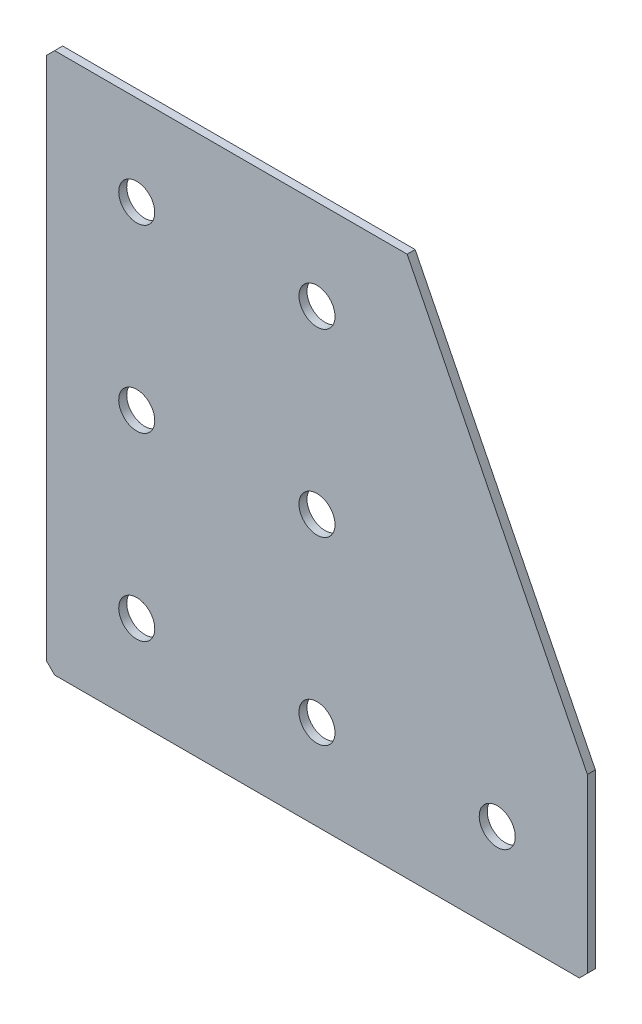
ISO-10303-21;
HEADER;
FILE_DESCRIPTION(('STEP AP214'),'2;1');
FILE_NAME('part.step','',(''),(''),'','','');
FILE_SCHEMA(('AUTOMOTIVE_DESIGN { 1 0 10303 214 1 1 1 1 }'));
ENDSEC;
DATA;
#1=APPLICATION_CONTEXT('core data for automotive mechanical design processes');
#2=APPLICATION_PROTOCOL_DEFINITION('international standard','automotive_design',2000,#1);
#3=PRODUCT_CONTEXT('',#1,'mechanical');
#4=PRODUCT('Part','Part','',(#3));
#5=PRODUCT_RELATED_PRODUCT_CATEGORY('part','',(#4));
#6=PRODUCT_DEFINITION_FORMATION('','',#4);
#7=PRODUCT_DEFINITION_CONTEXT('part definition',#1,'design');
#8=PRODUCT_DEFINITION('design','',#6,#7);
#9=PRODUCT_DEFINITION_SHAPE('','',#8);
#10=(LENGTH_UNIT() NAMED_UNIT(*) SI_UNIT(.MILLI.,.METRE.));
#11=(NAMED_UNIT(*) PLANE_ANGLE_UNIT() SI_UNIT($,.RADIAN.));
#12=(NAMED_UNIT(*) SI_UNIT($,.STERADIAN.) SOLID_ANGLE_UNIT());
#13=UNCERTAINTY_MEASURE_WITH_UNIT(LENGTH_MEASURE(1.E-05),#10,'distance_accuracy_value','');
#14=(GEOMETRIC_REPRESENTATION_CONTEXT(3) GLOBAL_UNCERTAINTY_ASSIGNED_CONTEXT((#13)) GLOBAL_UNIT_ASSIGNED_CONTEXT((#10,
#11,#12)) REPRESENTATION_CONTEXT('',''));
#15=CARTESIAN_POINT('',(0.,0.,0.));
#16=DIRECTION('',(0.,0.,1.));
#17=DIRECTION('',(1.,0.,0.));
#18=AXIS2_PLACEMENT_3D('',#15,#16,#17);
#19=CARTESIAN_POINT('',(90.,0.,-2.));
#20=DIRECTION('',(0.,-1.,0.));
#21=DIRECTION('',(1.,0.,0.));
#22=AXIS2_PLACEMENT_3D('',#19,#20,#21);
#23=PLANE('',#22);
#24=DIRECTION('',(1.,0.,0.));
#25=VECTOR('',#24,1.);
#26=CARTESIAN_POINT('',(90.,0.,-2.));
#27=LINE('',#26,#25);
#28=CARTESIAN_POINT('',(2.00000000000003,0.,-2.));
#29=VERTEX_POINT('',#28);
#30=CARTESIAN_POINT('',(90.,0.,-2.));
#31=VERTEX_POINT('',#30);
#32=EDGE_CURVE('E101',#29,#31,#27,.T.);
#33=ORIENTED_EDGE('',*,*,#32,.F.);
#34=DIRECTION('',(0.,0.,1.));
#35=VECTOR('',#34,1.);
#36=CARTESIAN_POINT('',(2.,0.,-2.));
#37=LINE('',#36,#35);
#38=CARTESIAN_POINT('',(2.00000000000003,0.,0.));
#39=VERTEX_POINT('',#38);
#40=EDGE_CURVE('E127',#29,#39,#37,.T.);
#41=ORIENTED_EDGE('',*,*,#40,.T.);
#42=DIRECTION('',(1.,0.,0.));
#43=VECTOR('',#42,1.);
#44=CARTESIAN_POINT('',(90.,0.,0.));
#45=LINE('',#44,#43);
#46=CARTESIAN_POINT('',(90.,0.,0.));
#47=VERTEX_POINT('',#46);
#48=EDGE_CURVE('E125',#39,#47,#45,.T.);
#49=ORIENTED_EDGE('',*,*,#48,.T.);
#50=DIRECTION('',(0.,0.,1.));
#51=VECTOR('',#50,1.);
#52=CARTESIAN_POINT('',(90.,0.,-2.));
#53=LINE('',#52,#51);
#54=EDGE_CURVE('E118',#31,#47,#53,.T.);
#55=ORIENTED_EDGE('',*,*,#54,.F.);
#56=EDGE_LOOP('',(#33,#41,#49,#55));
#57=FACE_BOUND('',#56,.T.);
#58=ADVANCED_FACE('F37',(#57),#23,.F.);
#59=CARTESIAN_POINT('',(135.,-90.,-2.));
#60=DIRECTION('',(-0.894427190999916,-0.447213595499958,0.));
#61=DIRECTION('',(0.447213595499958,-0.894427190999916,0.));
#62=AXIS2_PLACEMENT_3D('',#59,#60,#61);
#63=PLANE('',#62);
#64=DIRECTION('',(0.447213595499958,-0.894427190999916,0.));
#65=VECTOR('',#64,1.);
#66=CARTESIAN_POINT('',(135.,-90.,0.));
#67=LINE('',#66,#65);
#68=CARTESIAN_POINT('',(135.,-90.,0.));
#69=VERTEX_POINT('',#68);
#70=EDGE_CURVE('E164',#47,#69,#67,.T.);
#71=ORIENTED_EDGE('',*,*,#70,.T.);
#72=DIRECTION('',(0.,0.,1.));
#73=VECTOR('',#72,1.);
#74=CARTESIAN_POINT('',(135.,-90.,-2.));
#75=LINE('',#74,#73);
#76=CARTESIAN_POINT('',(135.,-90.,-2.));
#77=VERTEX_POINT('',#76);
#78=EDGE_CURVE('E120',#77,#69,#75,.T.);
#79=ORIENTED_EDGE('',*,*,#78,.F.);
#80=DIRECTION('',(0.447213595499958,-0.894427190999916,0.));
#81=VECTOR('',#80,1.);
#82=CARTESIAN_POINT('',(135.,-90.,-2.));
#83=LINE('',#82,#81);
#84=EDGE_CURVE('E105',#31,#77,#83,.T.);
#85=ORIENTED_EDGE('',*,*,#84,.F.);
#86=ORIENTED_EDGE('',*,*,#54,.T.);
#87=EDGE_LOOP('',(#71,#79,#85,#86));
#88=FACE_BOUND('',#87,.T.);
#89=ADVANCED_FACE('F117',(#88),#63,.F.);
#90=CARTESIAN_POINT('',(135.,-135.,-2.));
#91=DIRECTION('',(-1.,0.,0.));
#92=DIRECTION('',(0.,0.,1.));
#93=AXIS2_PLACEMENT_3D('',#90,#91,#92);
#94=PLANE('',#93);
#95=DIRECTION('',(0.,-1.,0.));
#96=VECTOR('',#95,1.);
#97=CARTESIAN_POINT('',(135.,-135.,0.));
#98=LINE('',#97,#96);
#99=CARTESIAN_POINT('',(135.,-133.,0.));
#100=VERTEX_POINT('',#99);
#101=EDGE_CURVE('E161',#69,#100,#98,.T.);
#102=ORIENTED_EDGE('',*,*,#101,.T.);
#103=DIRECTION('',(0.,0.,-1.));
#104=VECTOR('',#103,1.);
#105=CARTESIAN_POINT('',(135.,-133.,-2.));
#106=LINE('',#105,#104);
#107=CARTESIAN_POINT('',(135.,-133.,-2.));
#108=VERTEX_POINT('',#107);
#109=EDGE_CURVE('E11',#100,#108,#106,.T.);
#110=ORIENTED_EDGE('',*,*,#109,.T.);
#111=DIRECTION('',(0.,-1.,0.));
#112=VECTOR('',#111,1.);
#113=CARTESIAN_POINT('',(135.,-135.,-2.));
#114=LINE('',#113,#112);
#115=EDGE_CURVE('E122',#77,#108,#114,.T.);
#116=ORIENTED_EDGE('',*,*,#115,.F.);
#117=ORIENTED_EDGE('',*,*,#78,.T.);
#118=EDGE_LOOP('',(#102,#110,#116,#117));
#119=FACE_BOUND('',#118,.T.);
#120=ADVANCED_FACE('F253',(#119),#94,.F.);
#121=CARTESIAN_POINT('',(0.,-135.,-2.));
#122=DIRECTION('',(0.,1.,0.));
#123=DIRECTION('',(0.,0.,1.));
#124=AXIS2_PLACEMENT_3D('',#121,#122,#123);
#125=PLANE('',#124);
#126=DIRECTION('',(-1.,0.,0.));
#127=VECTOR('',#126,1.);
#128=CARTESIAN_POINT('',(0.,-135.,-2.));
#129=LINE('',#128,#127);
#130=CARTESIAN_POINT('',(133.,-135.,-2.));
#131=VERTEX_POINT('',#130);
#132=CARTESIAN_POINT('',(2.,-135.,-2.));
#133=VERTEX_POINT('',#132);
#134=EDGE_CURVE('E154',#131,#133,#129,.T.);
#135=ORIENTED_EDGE('',*,*,#134,.F.);
#136=DIRECTION('',(0.,0.,1.));
#137=VECTOR('',#136,1.);
#138=CARTESIAN_POINT('',(133.,-135.,-2.));
#139=LINE('',#138,#137);
#140=CARTESIAN_POINT('',(133.,-135.,0.));
#141=VERTEX_POINT('',#140);
#142=EDGE_CURVE('E45',#131,#141,#139,.T.);
#143=ORIENTED_EDGE('',*,*,#142,.T.);
#144=DIRECTION('',(-1.,0.,0.));
#145=VECTOR('',#144,1.);
#146=CARTESIAN_POINT('',(0.,-135.,0.));
#147=LINE('',#146,#145);
#148=CARTESIAN_POINT('',(2.,-135.,0.));
#149=VERTEX_POINT('',#148);
#150=EDGE_CURVE('E153',#141,#149,#147,.T.);
#151=ORIENTED_EDGE('',*,*,#150,.T.);
#152=DIRECTION('',(0.,0.,-1.));
#153=VECTOR('',#152,1.);
#154=CARTESIAN_POINT('',(2.,-135.,-2.));
#155=LINE('',#154,#153);
#156=EDGE_CURVE('E52',#149,#133,#155,.T.);
#157=ORIENTED_EDGE('',*,*,#156,.T.);
#158=EDGE_LOOP('',(#135,#143,#151,#157));
#159=FACE_BOUND('',#158,.T.);
#160=ADVANCED_FACE('F152',(#159),#125,.F.);
#161=CARTESIAN_POINT('',(0.,0.,-2.));
#162=DIRECTION('',(1.,0.,0.));
#163=DIRECTION('',(0.,0.,-1.));
#164=AXIS2_PLACEMENT_3D('',#161,#162,#163);
#165=PLANE('',#164);
#166=DIRECTION('',(0.,1.,0.));
#167=VECTOR('',#166,1.);
#168=CARTESIAN_POINT('',(0.,0.,0.));
#169=LINE('',#168,#167);
#170=CARTESIAN_POINT('',(0.,-133.,0.));
#171=VERTEX_POINT('',#170);
#172=CARTESIAN_POINT('',(0.,-2.00000000000003,0.));
#173=VERTEX_POINT('',#172);
#174=EDGE_CURVE('E113',#171,#173,#169,.T.);
#175=ORIENTED_EDGE('',*,*,#174,.T.);
#176=DIRECTION('',(0.,0.,-1.));
#177=VECTOR('',#176,1.);
#178=CARTESIAN_POINT('',(0.,-2.00000000000003,-2.));
#179=LINE('',#178,#177);
#180=CARTESIAN_POINT('',(0.,-2.00000000000003,-2.));
#181=VERTEX_POINT('',#180);
#182=EDGE_CURVE('E143',#173,#181,#179,.T.);
#183=ORIENTED_EDGE('',*,*,#182,.T.);
#184=DIRECTION('',(0.,1.,0.));
#185=VECTOR('',#184,1.);
#186=CARTESIAN_POINT('',(0.,0.,-2.));
#187=LINE('',#186,#185);
#188=CARTESIAN_POINT('',(0.,-133.,-2.));
#189=VERTEX_POINT('',#188);
#190=EDGE_CURVE('E131',#189,#181,#187,.T.);
#191=ORIENTED_EDGE('',*,*,#190,.F.);
#192=DIRECTION('',(0.,0.,1.));
#193=VECTOR('',#192,1.);
#194=CARTESIAN_POINT('',(0.,-133.,-2.));
#195=LINE('',#194,#193);
#196=EDGE_CURVE('E140',#189,#171,#195,.T.);
#197=ORIENTED_EDGE('',*,*,#196,.T.);
#198=EDGE_LOOP('',(#175,#183,#191,#197));
#199=FACE_BOUND('',#198,.T.);
#200=ADVANCED_FACE('F219',(#199),#165,.F.);
#201=CARTESIAN_POINT('',(0.,0.,-2.));
#202=DIRECTION('',(0.,0.,1.));
#203=DIRECTION('',(1.,0.,0.));
#204=AXIS2_PLACEMENT_3D('',#201,#202,#203);
#205=PLANE('',#204);
#206=CARTESIAN_POINT('',(67.5,-112.5,-2.00000000000001));
#207=DIRECTION('',(0.,0.,-1.));
#208=DIRECTION('',(0.,1.,0.));
#209=AXIS2_PLACEMENT_3D('',#206,#207,#208);
#210=CIRCLE('',#209,4.5);
#211=CARTESIAN_POINT('',(67.5,-108.,-2.00000000000001));
#212=VERTEX_POINT('',#211);
#213=EDGE_CURVE('E211',#212,#212,#210,.T.);
#214=ORIENTED_EDGE('',*,*,#213,.F.);
#215=EDGE_LOOP('',(#214));
#216=FACE_BOUND('',#215,.T.);
#217=CARTESIAN_POINT('',(22.5,-112.5,-2.00000000000001));
#218=DIRECTION('',(0.,0.,-1.));
#219=DIRECTION('',(0.,1.,0.));
#220=AXIS2_PLACEMENT_3D('',#217,#218,#219);
#221=CIRCLE('',#220,4.5);
#222=CARTESIAN_POINT('',(22.5,-108.,-2.00000000000001));
#223=VERTEX_POINT('',#222);
#224=EDGE_CURVE('E205',#223,#223,#221,.T.);
#225=ORIENTED_EDGE('',*,*,#224,.F.);
#226=EDGE_LOOP('',(#225));
#227=FACE_BOUND('',#226,.T.);
#228=CARTESIAN_POINT('',(22.5,-67.5,-2.));
#229=DIRECTION('',(0.,0.,-1.));
#230=DIRECTION('',(0.,1.,0.));
#231=AXIS2_PLACEMENT_3D('',#228,#229,#230);
#232=CIRCLE('',#231,4.5);
#233=CARTESIAN_POINT('',(22.5,-63.,-2.));
#234=VERTEX_POINT('',#233);
#235=EDGE_CURVE('E199',#234,#234,#232,.T.);
#236=ORIENTED_EDGE('',*,*,#235,.F.);
#237=EDGE_LOOP('',(#236));
#238=FACE_BOUND('',#237,.T.);
#239=CARTESIAN_POINT('',(22.5,-22.5,-2.));
#240=DIRECTION('',(0.,0.,-1.));
#241=DIRECTION('',(0.,1.,0.));
#242=AXIS2_PLACEMENT_3D('',#239,#240,#241);
#243=CIRCLE('',#242,4.5);
#244=CARTESIAN_POINT('',(22.5,-18.,-2.));
#245=VERTEX_POINT('',#244);
#246=EDGE_CURVE('E193',#245,#245,#243,.T.);
#247=ORIENTED_EDGE('',*,*,#246,.F.);
#248=EDGE_LOOP('',(#247));
#249=FACE_BOUND('',#248,.T.);
#250=CARTESIAN_POINT('',(112.5,-112.5,-2.00000000000001));
#251=DIRECTION('',(0.,0.,-1.));
#252=DIRECTION('',(0.,1.,0.));
#253=AXIS2_PLACEMENT_3D('',#250,#251,#252);
#254=CIRCLE('',#253,4.5);
#255=CARTESIAN_POINT('',(112.5,-108.,-2.00000000000001));
#256=VERTEX_POINT('',#255);
#257=EDGE_CURVE('E187',#256,#256,#254,.T.);
#258=ORIENTED_EDGE('',*,*,#257,.F.);
#259=EDGE_LOOP('',(#258));
#260=FACE_BOUND('',#259,.T.);
#261=CARTESIAN_POINT('',(67.5,-67.5,-2.));
#262=DIRECTION('',(0.,0.,-1.));
#263=DIRECTION('',(0.,1.,0.));
#264=AXIS2_PLACEMENT_3D('',#261,#262,#263);
#265=CIRCLE('',#264,4.5);
#266=CARTESIAN_POINT('',(67.5,-63.,-2.));
#267=VERTEX_POINT('',#266);
#268=EDGE_CURVE('E181',#267,#267,#265,.T.);
#269=ORIENTED_EDGE('',*,*,#268,.F.);
#270=EDGE_LOOP('',(#269));
#271=FACE_BOUND('',#270,.T.);
#272=CARTESIAN_POINT('',(67.5,-22.5,-2.));
#273=DIRECTION('',(0.,0.,-1.));
#274=DIRECTION('',(0.,1.,0.));
#275=AXIS2_PLACEMENT_3D('',#272,#273,#274);
#276=CIRCLE('',#275,4.5);
#277=CARTESIAN_POINT('',(67.5,-18.,-2.));
#278=VERTEX_POINT('',#277);
#279=EDGE_CURVE('E175',#278,#278,#276,.T.);
#280=ORIENTED_EDGE('',*,*,#279,.F.);
#281=EDGE_LOOP('',(#280));
#282=FACE_BOUND('',#281,.T.);
#283=ORIENTED_EDGE('',*,*,#190,.T.);
#284=DIRECTION('',(-0.707106781186543,-0.707106781186552,0.));
#285=VECTOR('',#284,1.);
#286=CARTESIAN_POINT('',(2.,0.,-2.));
#287=LINE('',#286,#285);
#288=EDGE_CURVE('E108',#181,#29,#287,.F.);
#289=ORIENTED_EDGE('',*,*,#288,.T.);
#290=ORIENTED_EDGE('',*,*,#32,.T.);
#291=ORIENTED_EDGE('',*,*,#84,.T.);
#292=ORIENTED_EDGE('',*,*,#115,.T.);
#293=DIRECTION('',(0.707106781186548,0.707106781186548,0.));
#294=VECTOR('',#293,1.);
#295=CARTESIAN_POINT('',(133.,-135.,-2.));
#296=LINE('',#295,#294);
#297=EDGE_CURVE('E59',#108,#131,#296,.F.);
#298=ORIENTED_EDGE('',*,*,#297,.T.);
#299=ORIENTED_EDGE('',*,*,#134,.T.);
#300=DIRECTION('',(0.707106781186548,-0.707106781186548,0.));
#301=VECTOR('',#300,1.);
#302=CARTESIAN_POINT('',(0.,-133.,-2.));
#303=LINE('',#302,#301);
#304=EDGE_CURVE('E145',#133,#189,#303,.F.);
#305=ORIENTED_EDGE('',*,*,#304,.T.);
#306=EDGE_LOOP('',(#283,#289,#290,#291,#292,#298,#299,#305));
#307=FACE_BOUND('',#306,.T.);
#308=ADVANCED_FACE('F104',(#216,#227,#238,#249,#260,#271,#282,#307),#205,.F.);
#309=CARTESIAN_POINT('',(0.,0.,0.));
#310=DIRECTION('',(0.,0.,1.));
#311=DIRECTION('',(1.,0.,0.));
#312=AXIS2_PLACEMENT_3D('',#309,#310,#311);
#313=PLANE('',#312);
#314=CARTESIAN_POINT('',(67.5,-112.5,0.));
#315=DIRECTION('',(0.,0.,-1.));
#316=DIRECTION('',(0.,1.,0.));
#317=AXIS2_PLACEMENT_3D('',#314,#315,#316);
#318=CIRCLE('',#317,4.5);
#319=CARTESIAN_POINT('',(67.5,-108.,0.));
#320=VERTEX_POINT('',#319);
#321=EDGE_CURVE('E208',#320,#320,#318,.T.);
#322=ORIENTED_EDGE('',*,*,#321,.T.);
#323=EDGE_LOOP('',(#322));
#324=FACE_BOUND('',#323,.T.);
#325=CARTESIAN_POINT('',(22.5,-112.5,0.));
#326=DIRECTION('',(0.,0.,-1.));
#327=DIRECTION('',(0.,1.,0.));
#328=AXIS2_PLACEMENT_3D('',#325,#326,#327);
#329=CIRCLE('',#328,4.5);
#330=CARTESIAN_POINT('',(22.5,-108.,0.));
#331=VERTEX_POINT('',#330);
#332=EDGE_CURVE('E202',#331,#331,#329,.T.);
#333=ORIENTED_EDGE('',*,*,#332,.T.);
#334=EDGE_LOOP('',(#333));
#335=FACE_BOUND('',#334,.T.);
#336=CARTESIAN_POINT('',(22.5,-67.5,0.));
#337=DIRECTION('',(0.,0.,-1.));
#338=DIRECTION('',(0.,1.,0.));
#339=AXIS2_PLACEMENT_3D('',#336,#337,#338);
#340=CIRCLE('',#339,4.5);
#341=CARTESIAN_POINT('',(22.5,-63.,0.));
#342=VERTEX_POINT('',#341);
#343=EDGE_CURVE('E196',#342,#342,#340,.T.);
#344=ORIENTED_EDGE('',*,*,#343,.T.);
#345=EDGE_LOOP('',(#344));
#346=FACE_BOUND('',#345,.T.);
#347=CARTESIAN_POINT('',(22.5,-22.5,0.));
#348=DIRECTION('',(0.,0.,-1.));
#349=DIRECTION('',(0.,1.,0.));
#350=AXIS2_PLACEMENT_3D('',#347,#348,#349);
#351=CIRCLE('',#350,4.5);
#352=CARTESIAN_POINT('',(22.5,-18.,0.));
#353=VERTEX_POINT('',#352);
#354=EDGE_CURVE('E190',#353,#353,#351,.T.);
#355=ORIENTED_EDGE('',*,*,#354,.T.);
#356=EDGE_LOOP('',(#355));
#357=FACE_BOUND('',#356,.T.);
#358=CARTESIAN_POINT('',(112.5,-112.5,0.));
#359=DIRECTION('',(0.,0.,-1.));
#360=DIRECTION('',(0.,1.,0.));
#361=AXIS2_PLACEMENT_3D('',#358,#359,#360);
#362=CIRCLE('',#361,4.5);
#363=CARTESIAN_POINT('',(112.5,-108.,0.));
#364=VERTEX_POINT('',#363);
#365=EDGE_CURVE('E184',#364,#364,#362,.T.);
#366=ORIENTED_EDGE('',*,*,#365,.T.);
#367=EDGE_LOOP('',(#366));
#368=FACE_BOUND('',#367,.T.);
#369=CARTESIAN_POINT('',(67.5,-67.5,0.));
#370=DIRECTION('',(0.,0.,-1.));
#371=DIRECTION('',(0.,1.,0.));
#372=AXIS2_PLACEMENT_3D('',#369,#370,#371);
#373=CIRCLE('',#372,4.5);
#374=CARTESIAN_POINT('',(67.5,-63.,0.));
#375=VERTEX_POINT('',#374);
#376=EDGE_CURVE('E178',#375,#375,#373,.T.);
#377=ORIENTED_EDGE('',*,*,#376,.T.);
#378=EDGE_LOOP('',(#377));
#379=FACE_BOUND('',#378,.T.);
#380=CARTESIAN_POINT('',(67.5,-22.5,0.));
#381=DIRECTION('',(0.,0.,-1.));
#382=DIRECTION('',(0.,1.,0.));
#383=AXIS2_PLACEMENT_3D('',#380,#381,#382);
#384=CIRCLE('',#383,4.5);
#385=CARTESIAN_POINT('',(67.5,-18.,0.));
#386=VERTEX_POINT('',#385);
#387=EDGE_CURVE('E169',#386,#386,#384,.T.);
#388=ORIENTED_EDGE('',*,*,#387,.T.);
#389=EDGE_LOOP('',(#388));
#390=FACE_BOUND('',#389,.T.);
#391=ORIENTED_EDGE('',*,*,#48,.F.);
#392=DIRECTION('',(0.707106781186543,0.707106781186552,0.));
#393=VECTOR('',#392,1.);
#394=CARTESIAN_POINT('',(1.00000000000001,-1.,0.));
#395=LINE('',#394,#393);
#396=EDGE_CURVE('E138',#39,#173,#395,.F.);
#397=ORIENTED_EDGE('',*,*,#396,.T.);
#398=ORIENTED_EDGE('',*,*,#174,.F.);
#399=DIRECTION('',(-0.707106781186548,0.707106781186548,0.));
#400=VECTOR('',#399,1.);
#401=CARTESIAN_POINT('',(-66.5,-66.5,0.));
#402=LINE('',#401,#400);
#403=EDGE_CURVE('E129',#171,#149,#402,.F.);
#404=ORIENTED_EDGE('',*,*,#403,.T.);
#405=ORIENTED_EDGE('',*,*,#150,.F.);
#406=DIRECTION('',(-0.707106781186548,-0.707106781186548,0.));
#407=VECTOR('',#406,1.);
#408=CARTESIAN_POINT('',(134.,-134.,0.));
#409=LINE('',#408,#407);
#410=EDGE_CURVE('E136',#141,#100,#409,.F.);
#411=ORIENTED_EDGE('',*,*,#410,.T.);
#412=ORIENTED_EDGE('',*,*,#101,.F.);
#413=ORIENTED_EDGE('',*,*,#70,.F.);
#414=EDGE_LOOP('',(#391,#397,#398,#404,#405,#411,#412,#413));
#415=FACE_BOUND('',#414,.T.);
#416=ADVANCED_FACE('F157',(#324,#335,#346,#357,#368,#379,#390,#415),#313,.T.);
#417=CARTESIAN_POINT('',(67.5,-22.5,-2.));
#418=DIRECTION('',(0.,0.,-1.));
#419=DIRECTION('',(0.,1.,0.));
#420=AXIS2_PLACEMENT_3D('',#417,#418,#419);
#421=CYLINDRICAL_SURFACE('',#420,4.5);
#422=ORIENTED_EDGE('',*,*,#387,.F.);
#423=EDGE_LOOP('',(#422));
#424=FACE_BOUND('',#423,.T.);
#425=ORIENTED_EDGE('',*,*,#279,.T.);
#426=EDGE_LOOP('',(#425));
#427=FACE_BOUND('',#426,.T.);
#428=ADVANCED_FACE('F233',(#424,#427),#421,.F.);
#429=CARTESIAN_POINT('',(67.5,-67.5,-2.));
#430=DIRECTION('',(0.,0.,-1.));
#431=DIRECTION('',(0.,1.,0.));
#432=AXIS2_PLACEMENT_3D('',#429,#430,#431);
#433=CYLINDRICAL_SURFACE('',#432,4.5);
#434=ORIENTED_EDGE('',*,*,#376,.F.);
#435=EDGE_LOOP('',(#434));
#436=FACE_BOUND('',#435,.T.);
#437=ORIENTED_EDGE('',*,*,#268,.T.);
#438=EDGE_LOOP('',(#437));
#439=FACE_BOUND('',#438,.T.);
#440=ADVANCED_FACE('F235',(#436,#439),#433,.F.);
#441=CARTESIAN_POINT('',(112.5,-112.5,-2.00000000000001));
#442=DIRECTION('',(0.,0.,-1.));
#443=DIRECTION('',(0.,1.,0.));
#444=AXIS2_PLACEMENT_3D('',#441,#442,#443);
#445=CYLINDRICAL_SURFACE('',#444,4.5);
#446=ORIENTED_EDGE('',*,*,#365,.F.);
#447=EDGE_LOOP('',(#446));
#448=FACE_BOUND('',#447,.T.);
#449=ORIENTED_EDGE('',*,*,#257,.T.);
#450=EDGE_LOOP('',(#449));
#451=FACE_BOUND('',#450,.T.);
#452=ADVANCED_FACE('F242',(#448,#451),#445,.F.);
#453=CARTESIAN_POINT('',(22.5,-22.5,-2.));
#454=DIRECTION('',(0.,0.,-1.));
#455=DIRECTION('',(0.,1.,0.));
#456=AXIS2_PLACEMENT_3D('',#453,#454,#455);
#457=CYLINDRICAL_SURFACE('',#456,4.5);
#458=ORIENTED_EDGE('',*,*,#354,.F.);
#459=EDGE_LOOP('',(#458));
#460=FACE_BOUND('',#459,.T.);
#461=ORIENTED_EDGE('',*,*,#246,.T.);
#462=EDGE_LOOP('',(#461));
#463=FACE_BOUND('',#462,.T.);
#464=ADVANCED_FACE('F345',(#460,#463),#457,.F.);
#465=CARTESIAN_POINT('',(22.5,-67.5,-2.));
#466=DIRECTION('',(0.,0.,-1.));
#467=DIRECTION('',(0.,1.,0.));
#468=AXIS2_PLACEMENT_3D('',#465,#466,#467);
#469=CYLINDRICAL_SURFACE('',#468,4.5);
#470=ORIENTED_EDGE('',*,*,#343,.F.);
#471=EDGE_LOOP('',(#470));
#472=FACE_BOUND('',#471,.T.);
#473=ORIENTED_EDGE('',*,*,#235,.T.);
#474=EDGE_LOOP('',(#473));
#475=FACE_BOUND('',#474,.T.);
#476=ADVANCED_FACE('F337',(#472,#475),#469,.F.);
#477=CARTESIAN_POINT('',(22.5,-112.5,-2.00000000000001));
#478=DIRECTION('',(0.,0.,-1.));
#479=DIRECTION('',(0.,1.,0.));
#480=AXIS2_PLACEMENT_3D('',#477,#478,#479);
#481=CYLINDRICAL_SURFACE('',#480,4.5);
#482=ORIENTED_EDGE('',*,*,#332,.F.);
#483=EDGE_LOOP('',(#482));
#484=FACE_BOUND('',#483,.T.);
#485=ORIENTED_EDGE('',*,*,#224,.T.);
#486=EDGE_LOOP('',(#485));
#487=FACE_BOUND('',#486,.T.);
#488=ADVANCED_FACE('F330',(#484,#487),#481,.F.);
#489=CARTESIAN_POINT('',(67.5,-112.5,-2.00000000000001));
#490=DIRECTION('',(0.,0.,-1.));
#491=DIRECTION('',(0.,1.,0.));
#492=AXIS2_PLACEMENT_3D('',#489,#490,#491);
#493=CYLINDRICAL_SURFACE('',#492,4.5);
#494=ORIENTED_EDGE('',*,*,#321,.F.);
#495=EDGE_LOOP('',(#494));
#496=FACE_BOUND('',#495,.T.);
#497=ORIENTED_EDGE('',*,*,#213,.T.);
#498=EDGE_LOOP('',(#497));
#499=FACE_BOUND('',#498,.T.);
#500=ADVANCED_FACE('F215',(#496,#499),#493,.F.);
#501=CARTESIAN_POINT('',(2.,0.,-2.));
#502=DIRECTION('',(0.707106781186552,-0.707106781186542,0.));
#503=DIRECTION('',(0.,0.,1.));
#504=AXIS2_PLACEMENT_3D('',#501,#502,#503);
#505=PLANE('',#504);
#506=ORIENTED_EDGE('',*,*,#288,.F.);
#507=ORIENTED_EDGE('',*,*,#182,.F.);
#508=ORIENTED_EDGE('',*,*,#396,.F.);
#509=ORIENTED_EDGE('',*,*,#40,.F.);
#510=EDGE_LOOP('',(#506,#507,#508,#509));
#511=FACE_BOUND('',#510,.T.);
#512=ADVANCED_FACE('F257',(#511),#505,.F.);
#513=CARTESIAN_POINT('',(133.,-135.,-2.));
#514=DIRECTION('',(-0.707106781186547,0.707106781186547,0.));
#515=DIRECTION('',(0.,0.,1.));
#516=AXIS2_PLACEMENT_3D('',#513,#514,#515);
#517=PLANE('',#516);
#518=ORIENTED_EDGE('',*,*,#297,.F.);
#519=ORIENTED_EDGE('',*,*,#109,.F.);
#520=ORIENTED_EDGE('',*,*,#410,.F.);
#521=ORIENTED_EDGE('',*,*,#142,.F.);
#522=EDGE_LOOP('',(#518,#519,#520,#521));
#523=FACE_BOUND('',#522,.T.);
#524=ADVANCED_FACE('F259',(#523),#517,.F.);
#525=CARTESIAN_POINT('',(0.,-133.,-2.));
#526=DIRECTION('',(0.707106781186547,0.707106781186547,0.));
#527=DIRECTION('',(0.,0.,1.));
#528=AXIS2_PLACEMENT_3D('',#525,#526,#527);
#529=PLANE('',#528);
#530=ORIENTED_EDGE('',*,*,#304,.F.);
#531=ORIENTED_EDGE('',*,*,#156,.F.);
#532=ORIENTED_EDGE('',*,*,#403,.F.);
#533=ORIENTED_EDGE('',*,*,#196,.F.);
#534=EDGE_LOOP('',(#530,#531,#532,#533));
#535=FACE_BOUND('',#534,.T.);
#536=ADVANCED_FACE('F39',(#535),#529,.F.);
#537=CLOSED_SHELL('',(#58,#89,#120,#160,#200,#308,#416,#428,#440,#452,#464,#476,#488,#500,#512,
#524,#536));
#538=MANIFOLD_SOLID_BREP('B2',#537);
#539=ADVANCED_BREP_SHAPE_REPRESENTATION('',(#18,#538),#14);
#540=SHAPE_DEFINITION_REPRESENTATION(#9,#539);
ENDSEC;
END-ISO-10303-21;
